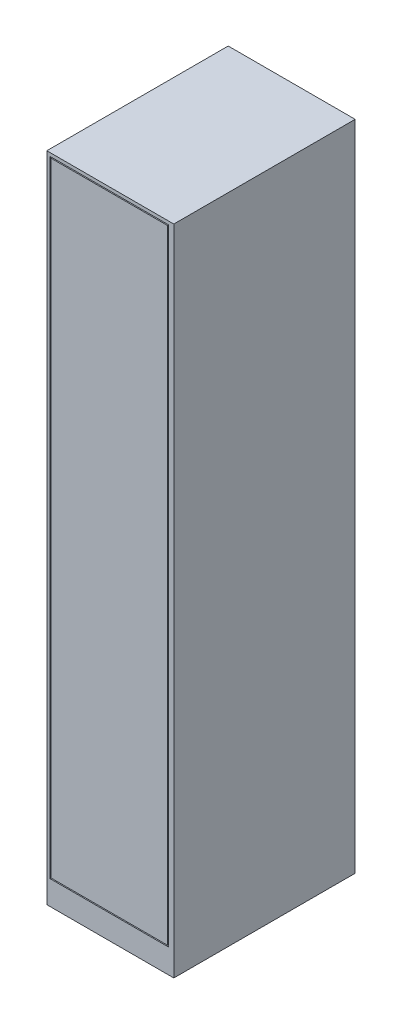
ISO-10303-21;
HEADER;
FILE_DESCRIPTION(('STEP AP214'),'2;1');
FILE_NAME('part.step','',(''),(''),'','','');
FILE_SCHEMA(('AUTOMOTIVE_DESIGN { 1 0 10303 214 1 1 1 1 }'));
ENDSEC;
DATA;
#1=APPLICATION_CONTEXT('core data for automotive mechanical design processes');
#2=APPLICATION_PROTOCOL_DEFINITION('international standard','automotive_design',2000,#1);
#3=PRODUCT_CONTEXT('',#1,'mechanical');
#4=PRODUCT('Part','Part','',(#3));
#5=PRODUCT_RELATED_PRODUCT_CATEGORY('part','',(#4));
#6=PRODUCT_DEFINITION_FORMATION('','',#4);
#7=PRODUCT_DEFINITION_CONTEXT('part definition',#1,'design');
#8=PRODUCT_DEFINITION('design','',#6,#7);
#9=PRODUCT_DEFINITION_SHAPE('','',#8);
#10=(LENGTH_UNIT() NAMED_UNIT(*) SI_UNIT(.MILLI.,.METRE.));
#11=(NAMED_UNIT(*) PLANE_ANGLE_UNIT() SI_UNIT($,.RADIAN.));
#12=(NAMED_UNIT(*) SI_UNIT($,.STERADIAN.) SOLID_ANGLE_UNIT());
#13=UNCERTAINTY_MEASURE_WITH_UNIT(LENGTH_MEASURE(1.E-05),#10,'distance_accuracy_value','');
#14=(GEOMETRIC_REPRESENTATION_CONTEXT(3) GLOBAL_UNCERTAINTY_ASSIGNED_CONTEXT((#13)) GLOBAL_UNIT_ASSIGNED_CONTEXT((#10,
#11,#12)) REPRESENTATION_CONTEXT('',''));
#15=CARTESIAN_POINT('',(0.,0.,0.));
#16=DIRECTION('',(0.,0.,1.));
#17=DIRECTION('',(1.,0.,0.));
#18=AXIS2_PLACEMENT_3D('',#15,#16,#17);
#19=CARTESIAN_POINT('',(0.,0.,500.));
#20=DIRECTION('',(1.,0.,0.));
#21=DIRECTION('',(0.,0.,-1.));
#22=AXIS2_PLACEMENT_3D('',#19,#20,#21);
#23=PLANE('',#22);
#24=DIRECTION('',(0.,-1.,0.));
#25=VECTOR('',#24,1.);
#26=CARTESIAN_POINT('',(0.,0.,0.));
#27=LINE('',#26,#25);
#28=CARTESIAN_POINT('',(0.,1800.,0.));
#29=VERTEX_POINT('',#28);
#30=CARTESIAN_POINT('',(0.,0.,0.));
#31=VERTEX_POINT('',#30);
#32=EDGE_CURVE('E211',#29,#31,#27,.T.);
#33=ORIENTED_EDGE('',*,*,#32,.T.);
#34=DIRECTION('',(0.,0.,-1.));
#35=VECTOR('',#34,1.);
#36=CARTESIAN_POINT('',(0.,0.,500.));
#37=LINE('',#36,#35);
#38=CARTESIAN_POINT('',(0.,0.,500.));
#39=VERTEX_POINT('',#38);
#40=EDGE_CURVE('E12',#39,#31,#37,.T.);
#41=ORIENTED_EDGE('',*,*,#40,.F.);
#42=DIRECTION('',(0.,-1.,0.));
#43=VECTOR('',#42,1.);
#44=CARTESIAN_POINT('',(0.,0.,500.));
#45=LINE('',#44,#43);
#46=CARTESIAN_POINT('',(0.,1800.,500.));
#47=VERTEX_POINT('',#46);
#48=EDGE_CURVE('E217',#47,#39,#45,.T.);
#49=ORIENTED_EDGE('',*,*,#48,.F.);
#50=DIRECTION('',(0.,0.,-1.));
#51=VECTOR('',#50,1.);
#52=CARTESIAN_POINT('',(0.,1800.,500.));
#53=LINE('',#52,#51);
#54=EDGE_CURVE('E227',#47,#29,#53,.T.);
#55=ORIENTED_EDGE('',*,*,#54,.T.);
#56=EDGE_LOOP('',(#33,#41,#49,#55));
#57=FACE_BOUND('',#56,.T.);
#58=ADVANCED_FACE('F57',(#57),#23,.F.);
#59=CARTESIAN_POINT('',(0.,0.,500.));
#60=DIRECTION('',(0.,1.,0.));
#61=DIRECTION('',(0.,0.,1.));
#62=AXIS2_PLACEMENT_3D('',#59,#60,#61);
#63=PLANE('',#62);
#64=DIRECTION('',(1.,0.,0.));
#65=VECTOR('',#64,1.);
#66=CARTESIAN_POINT('',(0.,0.,0.));
#67=LINE('',#66,#65);
#68=CARTESIAN_POINT('',(350.,0.,0.));
#69=VERTEX_POINT('',#68);
#70=EDGE_CURVE('E230',#31,#69,#67,.T.);
#71=ORIENTED_EDGE('',*,*,#70,.T.);
#72=DIRECTION('',(0.,0.,-1.));
#73=VECTOR('',#72,1.);
#74=CARTESIAN_POINT('',(350.,0.,500.));
#75=LINE('',#74,#73);
#76=CARTESIAN_POINT('',(350.,0.,500.));
#77=VERTEX_POINT('',#76);
#78=EDGE_CURVE('E64',#77,#69,#75,.T.);
#79=ORIENTED_EDGE('',*,*,#78,.F.);
#80=DIRECTION('',(1.,0.,0.));
#81=VECTOR('',#80,1.);
#82=CARTESIAN_POINT('',(0.,0.,500.));
#83=LINE('',#82,#81);
#84=EDGE_CURVE('E220',#39,#77,#83,.T.);
#85=ORIENTED_EDGE('',*,*,#84,.F.);
#86=ORIENTED_EDGE('',*,*,#40,.T.);
#87=EDGE_LOOP('',(#71,#79,#85,#86));
#88=FACE_BOUND('',#87,.T.);
#89=ADVANCED_FACE('F260',(#88),#63,.F.);
#90=CARTESIAN_POINT('',(350.,0.,500.));
#91=DIRECTION('',(-1.,0.,0.));
#92=DIRECTION('',(0.,0.,1.));
#93=AXIS2_PLACEMENT_3D('',#90,#91,#92);
#94=PLANE('',#93);
#95=DIRECTION('',(0.,1.,0.));
#96=VECTOR('',#95,1.);
#97=CARTESIAN_POINT('',(350.,0.,0.));
#98=LINE('',#97,#96);
#99=CARTESIAN_POINT('',(350.,1800.,0.));
#100=VERTEX_POINT('',#99);
#101=EDGE_CURVE('E232',#69,#100,#98,.T.);
#102=ORIENTED_EDGE('',*,*,#101,.T.);
#103=DIRECTION('',(0.,0.,-1.));
#104=VECTOR('',#103,1.);
#105=CARTESIAN_POINT('',(350.,1800.,500.));
#106=LINE('',#105,#104);
#107=CARTESIAN_POINT('',(350.,1800.,500.));
#108=VERTEX_POINT('',#107);
#109=EDGE_CURVE('E237',#108,#100,#106,.T.);
#110=ORIENTED_EDGE('',*,*,#109,.F.);
#111=DIRECTION('',(0.,1.,0.));
#112=VECTOR('',#111,1.);
#113=CARTESIAN_POINT('',(350.,0.,500.));
#114=LINE('',#113,#112);
#115=EDGE_CURVE('E223',#77,#108,#114,.T.);
#116=ORIENTED_EDGE('',*,*,#115,.F.);
#117=ORIENTED_EDGE('',*,*,#78,.T.);
#118=EDGE_LOOP('',(#102,#110,#116,#117));
#119=FACE_BOUND('',#118,.T.);
#120=ADVANCED_FACE('F244',(#119),#94,.F.);
#121=CARTESIAN_POINT('',(0.,1800.,500.));
#122=DIRECTION('',(0.,-1.,0.));
#123=DIRECTION('',(0.,0.,-1.));
#124=AXIS2_PLACEMENT_3D('',#121,#122,#123);
#125=PLANE('',#124);
#126=DIRECTION('',(-1.,0.,0.));
#127=VECTOR('',#126,1.);
#128=CARTESIAN_POINT('',(0.,1800.,0.));
#129=LINE('',#128,#127);
#130=EDGE_CURVE('E221',#100,#29,#129,.T.);
#131=ORIENTED_EDGE('',*,*,#130,.T.);
#132=ORIENTED_EDGE('',*,*,#54,.F.);
#133=DIRECTION('',(-1.,0.,0.));
#134=VECTOR('',#133,1.);
#135=CARTESIAN_POINT('',(0.,1800.,500.));
#136=LINE('',#135,#134);
#137=EDGE_CURVE('E225',#108,#47,#136,.T.);
#138=ORIENTED_EDGE('',*,*,#137,.F.);
#139=ORIENTED_EDGE('',*,*,#109,.T.);
#140=EDGE_LOOP('',(#131,#132,#138,#139));
#141=FACE_BOUND('',#140,.T.);
#142=ADVANCED_FACE('F253',(#141),#125,.F.);
#143=CARTESIAN_POINT('',(0.,0.,500.));
#144=DIRECTION('',(0.,0.,-1.));
#145=DIRECTION('',(-1.,0.,0.));
#146=AXIS2_PLACEMENT_3D('',#143,#144,#145);
#147=PLANE('',#146);
#148=DIRECTION('',(1.,0.,0.));
#149=VECTOR('',#148,1.);
#150=CARTESIAN_POINT('',(8.8289967856543,66.6138813278274,500.));
#151=LINE('',#150,#149);
#152=CARTESIAN_POINT('',(8.8289967856543,66.6138813278274,500.));
#153=VERTEX_POINT('',#152);
#154=CARTESIAN_POINT('',(335.924694824258,66.6138813278274,500.));
#155=VERTEX_POINT('',#154);
#156=EDGE_CURVE('E201',#153,#155,#151,.T.);
#157=ORIENTED_EDGE('',*,*,#156,.F.);
#158=DIRECTION('',(0.,-1.,0.));
#159=VECTOR('',#158,1.);
#160=CARTESIAN_POINT('',(8.8289967856543,1790.85102605882,500.));
#161=LINE('',#160,#159);
#162=CARTESIAN_POINT('',(8.8289967856543,1790.85102605882,500.));
#163=VERTEX_POINT('',#162);
#164=EDGE_CURVE('E71',#163,#153,#161,.T.);
#165=ORIENTED_EDGE('',*,*,#164,.F.);
#166=DIRECTION('',(-1.,0.,0.));
#167=VECTOR('',#166,1.);
#168=CARTESIAN_POINT('',(8.8289967856543,1790.85102605882,500.));
#169=LINE('',#168,#167);
#170=CARTESIAN_POINT('',(335.924694824258,1790.85102605882,500.));
#171=VERTEX_POINT('',#170);
#172=EDGE_CURVE('E190',#171,#163,#169,.T.);
#173=ORIENTED_EDGE('',*,*,#172,.F.);
#174=DIRECTION('',(0.,1.,0.));
#175=VECTOR('',#174,1.);
#176=CARTESIAN_POINT('',(335.924694824258,1790.85102605882,500.));
#177=LINE('',#176,#175);
#178=EDGE_CURVE('E204',#155,#171,#177,.T.);
#179=ORIENTED_EDGE('',*,*,#178,.F.);
#180=EDGE_LOOP('',(#157,#165,#173,#179));
#181=FACE_BOUND('',#180,.T.);
#182=ORIENTED_EDGE('',*,*,#48,.T.);
#183=ORIENTED_EDGE('',*,*,#84,.T.);
#184=ORIENTED_EDGE('',*,*,#115,.T.);
#185=ORIENTED_EDGE('',*,*,#137,.T.);
#186=EDGE_LOOP('',(#182,#183,#184,#185));
#187=FACE_BOUND('',#186,.T.);
#188=ADVANCED_FACE('F259',(#181,#187),#147,.F.);
#189=CARTESIAN_POINT('',(0.,0.,0.));
#190=DIRECTION('',(0.,0.,-1.));
#191=DIRECTION('',(-1.,0.,0.));
#192=AXIS2_PLACEMENT_3D('',#189,#190,#191);
#193=PLANE('',#192);
#194=ORIENTED_EDGE('',*,*,#32,.F.);
#195=ORIENTED_EDGE('',*,*,#130,.F.);
#196=ORIENTED_EDGE('',*,*,#101,.F.);
#197=ORIENTED_EDGE('',*,*,#70,.F.);
#198=EDGE_LOOP('',(#194,#195,#196,#197));
#199=FACE_BOUND('',#198,.T.);
#200=ADVANCED_FACE('F250',(#199),#193,.T.);
#201=CARTESIAN_POINT('',(8.8289967856543,1790.85102605882,497.));
#202=DIRECTION('',(-1.,0.,0.));
#203=DIRECTION('',(0.,0.,1.));
#204=AXIS2_PLACEMENT_3D('',#201,#202,#203);
#205=PLANE('',#204);
#206=ORIENTED_EDGE('',*,*,#164,.T.);
#207=DIRECTION('',(0.,0.,1.));
#208=VECTOR('',#207,1.);
#209=CARTESIAN_POINT('',(8.8289967856543,66.6138813278274,497.));
#210=LINE('',#209,#208);
#211=CARTESIAN_POINT('',(8.8289967856543,66.6138813278274,497.));
#212=VERTEX_POINT('',#211);
#213=EDGE_CURVE('E199',#212,#153,#210,.T.);
#214=ORIENTED_EDGE('',*,*,#213,.F.);
#215=DIRECTION('',(0.,-1.,0.));
#216=VECTOR('',#215,1.);
#217=CARTESIAN_POINT('',(8.8289967856543,1790.85102605882,497.));
#218=LINE('',#217,#216);
#219=CARTESIAN_POINT('',(8.8289967856543,1790.85102605882,497.));
#220=VERTEX_POINT('',#219);
#221=EDGE_CURVE('E186',#220,#212,#218,.T.);
#222=ORIENTED_EDGE('',*,*,#221,.F.);
#223=DIRECTION('',(0.,0.,1.));
#224=VECTOR('',#223,1.);
#225=CARTESIAN_POINT('',(8.8289967856543,1790.85102605882,497.));
#226=LINE('',#225,#224);
#227=EDGE_CURVE('E209',#220,#163,#226,.T.);
#228=ORIENTED_EDGE('',*,*,#227,.T.);
#229=EDGE_LOOP('',(#206,#214,#222,#228));
#230=FACE_BOUND('',#229,.T.);
#231=ADVANCED_FACE('F272',(#230),#205,.F.);
#232=CARTESIAN_POINT('',(8.8289967856543,1790.85102605882,497.));
#233=DIRECTION('',(0.,1.,0.));
#234=DIRECTION('',(0.,0.,1.));
#235=AXIS2_PLACEMENT_3D('',#232,#233,#234);
#236=PLANE('',#235);
#237=ORIENTED_EDGE('',*,*,#172,.T.);
#238=ORIENTED_EDGE('',*,*,#227,.F.);
#239=DIRECTION('',(-1.,0.,0.));
#240=VECTOR('',#239,1.);
#241=CARTESIAN_POINT('',(8.8289967856543,1790.85102605882,497.));
#242=LINE('',#241,#240);
#243=CARTESIAN_POINT('',(335.924694824258,1790.85102605882,497.));
#244=VERTEX_POINT('',#243);
#245=EDGE_CURVE('E196',#244,#220,#242,.T.);
#246=ORIENTED_EDGE('',*,*,#245,.F.);
#247=DIRECTION('',(0.,0.,1.));
#248=VECTOR('',#247,1.);
#249=CARTESIAN_POINT('',(335.924694824258,1790.85102605882,497.));
#250=LINE('',#249,#248);
#251=EDGE_CURVE('E212',#244,#171,#250,.T.);
#252=ORIENTED_EDGE('',*,*,#251,.T.);
#253=EDGE_LOOP('',(#237,#238,#246,#252));
#254=FACE_BOUND('',#253,.T.);
#255=ADVANCED_FACE('F279',(#254),#236,.F.);
#256=CARTESIAN_POINT('',(335.924694824258,1790.85102605882,497.));
#257=DIRECTION('',(1.,0.,0.));
#258=DIRECTION('',(0.,0.,-1.));
#259=AXIS2_PLACEMENT_3D('',#256,#257,#258);
#260=PLANE('',#259);
#261=ORIENTED_EDGE('',*,*,#178,.T.);
#262=ORIENTED_EDGE('',*,*,#251,.F.);
#263=DIRECTION('',(0.,1.,0.));
#264=VECTOR('',#263,1.);
#265=CARTESIAN_POINT('',(335.924694824258,1790.85102605882,497.));
#266=LINE('',#265,#264);
#267=CARTESIAN_POINT('',(335.924694824258,66.6138813278274,497.));
#268=VERTEX_POINT('',#267);
#269=EDGE_CURVE('E193',#268,#244,#266,.T.);
#270=ORIENTED_EDGE('',*,*,#269,.F.);
#271=DIRECTION('',(0.,0.,1.));
#272=VECTOR('',#271,1.);
#273=CARTESIAN_POINT('',(335.924694824258,66.6138813278274,497.));
#274=LINE('',#273,#272);
#275=EDGE_CURVE('E214',#268,#155,#274,.T.);
#276=ORIENTED_EDGE('',*,*,#275,.T.);
#277=EDGE_LOOP('',(#261,#262,#270,#276));
#278=FACE_BOUND('',#277,.T.);
#279=ADVANCED_FACE('F283',(#278),#260,.F.);
#280=CARTESIAN_POINT('',(8.8289967856543,66.6138813278274,497.));
#281=DIRECTION('',(0.,-1.,0.));
#282=DIRECTION('',(0.,0.,-1.));
#283=AXIS2_PLACEMENT_3D('',#280,#281,#282);
#284=PLANE('',#283);
#285=ORIENTED_EDGE('',*,*,#156,.T.);
#286=ORIENTED_EDGE('',*,*,#275,.F.);
#287=DIRECTION('',(1.,0.,0.));
#288=VECTOR('',#287,1.);
#289=CARTESIAN_POINT('',(8.8289967856543,66.6138813278274,497.));
#290=LINE('',#289,#288);
#291=EDGE_CURVE('E189',#212,#268,#290,.T.);
#292=ORIENTED_EDGE('',*,*,#291,.F.);
#293=ORIENTED_EDGE('',*,*,#213,.T.);
#294=EDGE_LOOP('',(#285,#286,#292,#293));
#295=FACE_BOUND('',#294,.T.);
#296=ADVANCED_FACE('F280',(#295),#284,.F.);
#297=CARTESIAN_POINT('',(0.,0.,497.));
#298=DIRECTION('',(0.,0.,1.));
#299=DIRECTION('',(1.,0.,0.));
#300=AXIS2_PLACEMENT_3D('',#297,#298,#299);
#301=PLANE('',#300);
#302=DIRECTION('',(-1.,0.,0.));
#303=VECTOR('',#302,1.);
#304=CARTESIAN_POINT('',(8.8289967856543,1787.85102605882,497.));
#305=LINE('',#304,#303);
#306=CARTESIAN_POINT('',(332.924694824258,1787.85102605882,497.));
#307=VERTEX_POINT('',#306);
#308=CARTESIAN_POINT('',(11.8289967856543,1787.85102605882,497.));
#309=VERTEX_POINT('',#308);
#310=EDGE_CURVE('E157',#307,#309,#305,.T.);
#311=ORIENTED_EDGE('',*,*,#310,.F.);
#312=DIRECTION('',(0.,1.,0.));
#313=VECTOR('',#312,1.);
#314=CARTESIAN_POINT('',(332.924694824258,1790.85102605882,497.));
#315=LINE('',#314,#313);
#316=CARTESIAN_POINT('',(332.924694824258,69.6138813278274,497.));
#317=VERTEX_POINT('',#316);
#318=EDGE_CURVE('E167',#317,#307,#315,.T.);
#319=ORIENTED_EDGE('',*,*,#318,.F.);
#320=DIRECTION('',(1.,0.,0.));
#321=VECTOR('',#320,1.);
#322=CARTESIAN_POINT('',(8.8289967856543,69.6138813278274,497.));
#323=LINE('',#322,#321);
#324=CARTESIAN_POINT('',(11.8289967856543,69.6138813278274,497.));
#325=VERTEX_POINT('',#324);
#326=EDGE_CURVE('E149',#325,#317,#323,.T.);
#327=ORIENTED_EDGE('',*,*,#326,.F.);
#328=DIRECTION('',(0.,-1.,0.));
#329=VECTOR('',#328,1.);
#330=CARTESIAN_POINT('',(11.8289967856543,1790.85102605882,497.));
#331=LINE('',#330,#329);
#332=EDGE_CURVE('E164',#309,#325,#331,.T.);
#333=ORIENTED_EDGE('',*,*,#332,.F.);
#334=EDGE_LOOP('',(#311,#319,#327,#333));
#335=FACE_BOUND('',#334,.T.);
#336=ORIENTED_EDGE('',*,*,#221,.T.);
#337=ORIENTED_EDGE('',*,*,#291,.T.);
#338=ORIENTED_EDGE('',*,*,#269,.T.);
#339=ORIENTED_EDGE('',*,*,#245,.T.);
#340=EDGE_LOOP('',(#336,#337,#338,#339));
#341=FACE_BOUND('',#340,.T.);
#342=ADVANCED_FACE('F162',(#335,#341),#301,.T.);
#343=CARTESIAN_POINT('',(11.8289967856543,1790.85102605882,497.));
#344=DIRECTION('',(-1.,0.,0.));
#345=DIRECTION('',(0.,0.,1.));
#346=AXIS2_PLACEMENT_3D('',#343,#344,#345);
#347=PLANE('',#346);
#348=DIRECTION('',(0.,-1.,0.));
#349=VECTOR('',#348,1.);
#350=CARTESIAN_POINT('',(11.8289967856543,1790.85102605882,500.));
#351=LINE('',#350,#349);
#352=CARTESIAN_POINT('',(11.8289967856543,1787.85102605882,500.));
#353=VERTEX_POINT('',#352);
#354=CARTESIAN_POINT('',(11.8289967856543,69.6138813278274,500.));
#355=VERTEX_POINT('',#354);
#356=EDGE_CURVE('E178',#353,#355,#351,.T.);
#357=ORIENTED_EDGE('',*,*,#356,.F.);
#358=DIRECTION('',(0.,0.,1.));
#359=VECTOR('',#358,1.);
#360=CARTESIAN_POINT('',(11.8289967856543,1787.85102605882,497.));
#361=LINE('',#360,#359);
#362=EDGE_CURVE('E170',#309,#353,#361,.T.);
#363=ORIENTED_EDGE('',*,*,#362,.F.);
#364=ORIENTED_EDGE('',*,*,#332,.T.);
#365=DIRECTION('',(0.,0.,1.));
#366=VECTOR('',#365,1.);
#367=CARTESIAN_POINT('',(11.8289967856543,69.6138813278274,497.));
#368=LINE('',#367,#366);
#369=EDGE_CURVE('E146',#325,#355,#368,.T.);
#370=ORIENTED_EDGE('',*,*,#369,.T.);
#371=EDGE_LOOP('',(#357,#363,#364,#370));
#372=FACE_BOUND('',#371,.T.);
#373=ADVANCED_FACE('F169',(#372),#347,.T.);
#374=CARTESIAN_POINT('',(8.8289967856543,1787.85102605882,497.));
#375=DIRECTION('',(0.,1.,0.));
#376=DIRECTION('',(0.,0.,1.));
#377=AXIS2_PLACEMENT_3D('',#374,#375,#376);
#378=PLANE('',#377);
#379=DIRECTION('',(-1.,0.,0.));
#380=VECTOR('',#379,1.);
#381=CARTESIAN_POINT('',(8.8289967856543,1787.85102605882,500.));
#382=LINE('',#381,#380);
#383=CARTESIAN_POINT('',(332.924694824258,1787.85102605882,500.));
#384=VERTEX_POINT('',#383);
#385=EDGE_CURVE('E171',#384,#353,#382,.T.);
#386=ORIENTED_EDGE('',*,*,#385,.F.);
#387=DIRECTION('',(0.,0.,1.));
#388=VECTOR('',#387,1.);
#389=CARTESIAN_POINT('',(332.924694824258,1787.85102605882,497.));
#390=LINE('',#389,#388);
#391=EDGE_CURVE('E183',#307,#384,#390,.T.);
#392=ORIENTED_EDGE('',*,*,#391,.F.);
#393=ORIENTED_EDGE('',*,*,#310,.T.);
#394=ORIENTED_EDGE('',*,*,#362,.T.);
#395=EDGE_LOOP('',(#386,#392,#393,#394));
#396=FACE_BOUND('',#395,.T.);
#397=ADVANCED_FACE('F295',(#396),#378,.T.);
#398=CARTESIAN_POINT('',(332.924694824258,1790.85102605882,497.));
#399=DIRECTION('',(1.,0.,0.));
#400=DIRECTION('',(0.,0.,-1.));
#401=AXIS2_PLACEMENT_3D('',#398,#399,#400);
#402=PLANE('',#401);
#403=DIRECTION('',(0.,1.,0.));
#404=VECTOR('',#403,1.);
#405=CARTESIAN_POINT('',(332.924694824258,1790.85102605882,500.));
#406=LINE('',#405,#404);
#407=CARTESIAN_POINT('',(332.924694824258,69.6138813278274,500.));
#408=VERTEX_POINT('',#407);
#409=EDGE_CURVE('E79',#408,#384,#406,.T.);
#410=ORIENTED_EDGE('',*,*,#409,.F.);
#411=DIRECTION('',(0.,0.,1.));
#412=VECTOR('',#411,1.);
#413=CARTESIAN_POINT('',(332.924694824258,69.6138813278274,497.));
#414=LINE('',#413,#412);
#415=EDGE_CURVE('E156',#317,#408,#414,.T.);
#416=ORIENTED_EDGE('',*,*,#415,.F.);
#417=ORIENTED_EDGE('',*,*,#318,.T.);
#418=ORIENTED_EDGE('',*,*,#391,.T.);
#419=EDGE_LOOP('',(#410,#416,#417,#418));
#420=FACE_BOUND('',#419,.T.);
#421=ADVANCED_FACE('F298',(#420),#402,.T.);
#422=CARTESIAN_POINT('',(8.8289967856543,69.6138813278274,497.));
#423=DIRECTION('',(0.,-1.,0.));
#424=DIRECTION('',(0.,0.,-1.));
#425=AXIS2_PLACEMENT_3D('',#422,#423,#424);
#426=PLANE('',#425);
#427=DIRECTION('',(1.,0.,0.));
#428=VECTOR('',#427,1.);
#429=CARTESIAN_POINT('',(8.8289967856543,69.6138813278274,500.));
#430=LINE('',#429,#428);
#431=EDGE_CURVE('E151',#355,#408,#430,.T.);
#432=ORIENTED_EDGE('',*,*,#431,.F.);
#433=ORIENTED_EDGE('',*,*,#369,.F.);
#434=ORIENTED_EDGE('',*,*,#326,.T.);
#435=ORIENTED_EDGE('',*,*,#415,.T.);
#436=EDGE_LOOP('',(#432,#433,#434,#435));
#437=FACE_BOUND('',#436,.T.);
#438=ADVANCED_FACE('F148',(#437),#426,.T.);
#439=ORIENTED_EDGE('',*,*,#356,.T.);
#440=ORIENTED_EDGE('',*,*,#431,.T.);
#441=ORIENTED_EDGE('',*,*,#409,.T.);
#442=ORIENTED_EDGE('',*,*,#385,.T.);
#443=EDGE_LOOP('',(#439,#440,#441,#442));
#444=FACE_BOUND('',#443,.T.);
#445=ADVANCED_FACE('F276',(#444),#147,.F.);
#446=CLOSED_SHELL('',(#58,#89,#120,#142,#188,#200,#231,#255,#279,#296,#342,#373,#397,#421,#438,#445));
#447=MANIFOLD_SOLID_BREP('B2',#446);
#448=ADVANCED_BREP_SHAPE_REPRESENTATION('',(#18,#447),#14);
#449=SHAPE_DEFINITION_REPRESENTATION(#9,#448);
ENDSEC;
END-ISO-10303-21;
